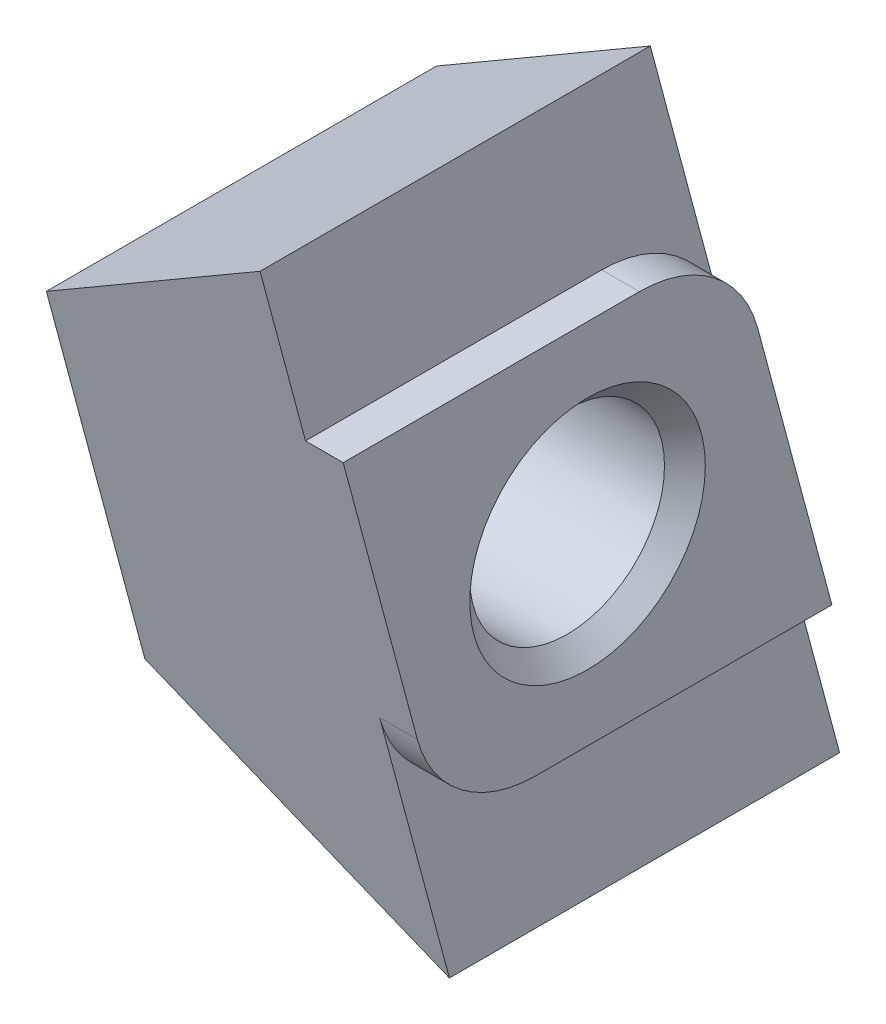
ISO-10303-21;
HEADER;
FILE_DESCRIPTION(('STEP AP214'),'2;1');
FILE_NAME('part.step','',(''),(''),'','','');
FILE_SCHEMA(('AUTOMOTIVE_DESIGN { 1 0 10303 214 1 1 1 1 }'));
ENDSEC;
DATA;
#1=APPLICATION_CONTEXT('core data for automotive mechanical design processes');
#2=APPLICATION_PROTOCOL_DEFINITION('international standard','automotive_design',2000,#1);
#3=PRODUCT_CONTEXT('',#1,'mechanical');
#4=PRODUCT('Part','Part','',(#3));
#5=PRODUCT_RELATED_PRODUCT_CATEGORY('part','',(#4));
#6=PRODUCT_DEFINITION_FORMATION('','',#4);
#7=PRODUCT_DEFINITION_CONTEXT('part definition',#1,'design');
#8=PRODUCT_DEFINITION('design','',#6,#7);
#9=PRODUCT_DEFINITION_SHAPE('','',#8);
#10=(LENGTH_UNIT() NAMED_UNIT(*) SI_UNIT(.MILLI.,.METRE.));
#11=(NAMED_UNIT(*) PLANE_ANGLE_UNIT() SI_UNIT($,.RADIAN.));
#12=(NAMED_UNIT(*) SI_UNIT($,.STERADIAN.) SOLID_ANGLE_UNIT());
#13=UNCERTAINTY_MEASURE_WITH_UNIT(LENGTH_MEASURE(1.E-05),#10,'distance_accuracy_value','');
#14=(GEOMETRIC_REPRESENTATION_CONTEXT(3) GLOBAL_UNCERTAINTY_ASSIGNED_CONTEXT((#13)) GLOBAL_UNIT_ASSIGNED_CONTEXT((#10,
#11,#12)) REPRESENTATION_CONTEXT('',''));
#15=CARTESIAN_POINT('',(0.,0.,0.));
#16=DIRECTION('',(0.,0.,1.));
#17=DIRECTION('',(1.,0.,0.));
#18=AXIS2_PLACEMENT_3D('',#15,#16,#17);
#19=CARTESIAN_POINT('',(-0.800000000000001,1.29999999999999,-1.10105270241365));
#20=DIRECTION('',(1.,0.,0.));
#21=DIRECTION('',(0.,0.,-1.));
#22=AXIS2_PLACEMENT_3D('',#19,#20,#21);
#23=CYLINDRICAL_SURFACE('',#22,2.60000000000001);
#24=CARTESIAN_POINT('',(0.,1.29999999999999,-1.10105270241365));
#25=DIRECTION('',(1.,0.,0.));
#26=DIRECTION('',(0.,0.,-1.));
#27=AXIS2_PLACEMENT_3D('',#24,#25,#26);
#28=CIRCLE('',#27,2.60000000000001);
#29=CARTESIAN_POINT('',(0.,1.97292951726655,-3.61245985076524));
#30=VERTEX_POINT('',#29);
#31=CARTESIAN_POINT('',(0.,3.9,-1.10105270241365));
#32=VERTEX_POINT('',#31);
#33=EDGE_CURVE('E154',#30,#32,#28,.T.);
#34=ORIENTED_EDGE('',*,*,#33,.F.);
#35=DIRECTION('',(1.,0.,0.));
#36=VECTOR('',#35,1.);
#37=CARTESIAN_POINT('',(-0.800000000000001,1.97292951726655,-3.61245985076524));
#38=LINE('',#37,#36);
#39=CARTESIAN_POINT('',(-0.800000000000001,1.97292951726655,-3.61245985076523));
#40=VERTEX_POINT('',#39);
#41=EDGE_CURVE('E172',#40,#30,#38,.T.);
#42=ORIENTED_EDGE('',*,*,#41,.F.);
#43=CARTESIAN_POINT('',(-0.800000000000001,1.29999999999999,-1.10105270241365));
#44=DIRECTION('',(1.,0.,0.));
#45=DIRECTION('',(0.,0.,-1.));
#46=AXIS2_PLACEMENT_3D('',#43,#44,#45);
#47=CIRCLE('',#46,2.60000000000001);
#48=CARTESIAN_POINT('',(-0.800000000000001,3.9,-1.10105270241365));
#49=VERTEX_POINT('',#48);
#50=EDGE_CURVE('E140',#40,#49,#47,.T.);
#51=ORIENTED_EDGE('',*,*,#50,.T.);
#52=DIRECTION('',(1.,0.,0.));
#53=VECTOR('',#52,1.);
#54=CARTESIAN_POINT('',(-0.800000000000001,3.9,-1.10105270241365));
#55=LINE('',#54,#53);
#56=EDGE_CURVE('E124',#49,#32,#55,.T.);
#57=ORIENTED_EDGE('',*,*,#56,.T.);
#58=EDGE_LOOP('',(#34,#42,#51,#57));
#59=FACE_BOUND('',#58,.T.);
#60=ADVANCED_FACE('F37',(#59),#23,.T.);
#61=CARTESIAN_POINT('',(-0.800000000000001,-3.9,-5.18610657212171));
#62=DIRECTION('',(0.,0.25881904510252,-0.965925826289068));
#63=DIRECTION('',(0.,0.965925826289068,0.25881904510252));
#64=AXIS2_PLACEMENT_3D('',#61,#62,#63);
#65=PLANE('',#64);
#66=DIRECTION('',(0.,0.965925826289068,0.25881904510252));
#67=VECTOR('',#66,1.);
#68=CARTESIAN_POINT('',(0.,-3.9,-5.18610657212171));
#69=LINE('',#68,#67);
#70=CARTESIAN_POINT('',(0.,-3.9,-5.18610657212171));
#71=VERTEX_POINT('',#70);
#72=EDGE_CURVE('E278',#71,#30,#69,.T.);
#73=ORIENTED_EDGE('',*,*,#72,.F.);
#74=DIRECTION('',(1.,0.,0.));
#75=VECTOR('',#74,1.);
#76=CARTESIAN_POINT('',(-0.800000000000001,-3.9,-5.18610657212171));
#77=LINE('',#76,#75);
#78=CARTESIAN_POINT('',(-0.800000000000001,-3.9,-5.18610657212171));
#79=VERTEX_POINT('',#78);
#80=EDGE_CURVE('E134',#79,#71,#77,.T.);
#81=ORIENTED_EDGE('',*,*,#80,.F.);
#82=CARTESIAN_POINT('',(-0.800000000000001,7.5,-2.13148577840691));
#83=CARTESIAN_POINT('',(-0.800000000000001,2.5,-3.47123174056252));
#84=CARTESIAN_POINT('',(-0.800000000000001,-2.5,-4.81097770271814));
#85=CARTESIAN_POINT('',(-0.800000000000001,-7.5,-6.15072366487375));
#86=B_SPLINE_CURVE_WITH_KNOTS('',3,(#82,#83,#84,#85),.UNSPECIFIED.,.F.,.F.,(4,4),(0.,1.),.UNSPECIFIED.);
#87=CARTESIAN_POINT('',(-0.800000000000001,-7.5,-6.15072366487375));
#88=VERTEX_POINT('',#87);
#89=EDGE_CURVE('E121',#79,#88,#86,.T.);
#90=ORIENTED_EDGE('',*,*,#89,.T.);
#91=DIRECTION('',(-0.827835666345006,0.541856072516727,0.145189897044757));
#92=VECTOR('',#91,1.);
#93=CARTESIAN_POINT('',(-2.53078460239917,-6.36712280570237,-5.84717013553806));
#94=LINE('',#93,#92);
#95=CARTESIAN_POINT('',(-6.3,-3.90000000000003,-5.18610657212172));
#96=VERTEX_POINT('',#95);
#97=EDGE_CURVE('E161',#96,#88,#94,.F.);
#98=ORIENTED_EDGE('',*,*,#97,.F.);
#99=CARTESIAN_POINT('',(-6.3,7.5,-2.13148577840691));
#100=CARTESIAN_POINT('',(-6.3,2.5,-3.47123174056252));
#101=CARTESIAN_POINT('',(-6.3,-2.5,-4.81097770271814));
#102=CARTESIAN_POINT('',(-6.3,-7.5,-6.15072366487375));
#103=B_SPLINE_CURVE_WITH_KNOTS('',3,(#99,#100,#101,#102),.UNSPECIFIED.,.F.,.F.,(4,4),(0.,1.),.UNSPECIFIED.);
#104=CARTESIAN_POINT('',(-6.3,3.90000000000003,-3.09610287115894));
#105=VERTEX_POINT('',#104);
#106=EDGE_CURVE('E88',#105,#96,#103,.T.);
#107=ORIENTED_EDGE('',*,*,#106,.F.);
#108=DIRECTION('',(-0.827835666345006,-0.541856072516727,-0.145189897044757));
#109=VECTOR('',#108,1.);
#110=CARTESIAN_POINT('',(-0.8,7.5,-2.13148577840691));
#111=LINE('',#110,#109);
#112=CARTESIAN_POINT('',(-0.800000000000001,7.5,-2.13148577840691));
#113=VERTEX_POINT('',#112);
#114=EDGE_CURVE('E155',#105,#113,#111,.F.);
#115=ORIENTED_EDGE('',*,*,#114,.T.);
#116=EDGE_CURVE('E228',#113,#40,#86,.T.);
#117=ORIENTED_EDGE('',*,*,#116,.T.);
#118=ORIENTED_EDGE('',*,*,#41,.T.);
#119=EDGE_LOOP('',(#73,#81,#90,#98,#107,#115,#117,#118));
#120=FACE_BOUND('',#119,.T.);
#121=ADVANCED_FACE('F198',(#120),#65,.T.);
#122=CARTESIAN_POINT('',(-0.800000000000001,-3.9,1.10105270241365));
#123=DIRECTION('',(0.,-1.,0.));
#124=DIRECTION('',(0.,0.,-1.));
#125=AXIS2_PLACEMENT_3D('',#122,#123,#124);
#126=PLANE('',#125);
#127=DIRECTION('',(0.,0.,-1.));
#128=VECTOR('',#127,1.);
#129=CARTESIAN_POINT('',(0.,-3.9,1.10105270241365));
#130=LINE('',#129,#128);
#131=CARTESIAN_POINT('',(0.,-3.9,1.10105270241365));
#132=VERTEX_POINT('',#131);
#133=EDGE_CURVE('E130',#132,#71,#130,.T.);
#134=ORIENTED_EDGE('',*,*,#133,.F.);
#135=DIRECTION('',(1.,0.,0.));
#136=VECTOR('',#135,1.);
#137=CARTESIAN_POINT('',(-0.800000000000001,-3.9,1.10105270241365));
#138=LINE('',#137,#136);
#139=CARTESIAN_POINT('',(-0.800000000000001,-3.9,1.10105270241365));
#140=VERTEX_POINT('',#139);
#141=EDGE_CURVE('E127',#140,#132,#138,.T.);
#142=ORIENTED_EDGE('',*,*,#141,.F.);
#143=DIRECTION('',(0.,0.,-1.));
#144=VECTOR('',#143,1.);
#145=CARTESIAN_POINT('',(-0.800000000000001,-3.9,1.10105270241365));
#146=LINE('',#145,#144);
#147=EDGE_CURVE('E116',#140,#79,#146,.T.);
#148=ORIENTED_EDGE('',*,*,#147,.T.);
#149=ORIENTED_EDGE('',*,*,#80,.T.);
#150=EDGE_LOOP('',(#134,#142,#148,#149));
#151=FACE_BOUND('',#150,.T.);
#152=ADVANCED_FACE('F128',(#151),#126,.T.);
#153=CARTESIAN_POINT('',(-0.800000000000001,-1.3,1.10105270241365));
#154=DIRECTION('',(1.,0.,0.));
#155=DIRECTION('',(0.,0.,-1.));
#156=AXIS2_PLACEMENT_3D('',#153,#154,#155);
#157=CYLINDRICAL_SURFACE('',#156,2.6);
#158=CARTESIAN_POINT('',(0.,-1.3,1.10105270241365));
#159=DIRECTION('',(1.,0.,0.));
#160=DIRECTION('',(0.,0.,-1.));
#161=AXIS2_PLACEMENT_3D('',#158,#159,#160);
#162=CIRCLE('',#161,2.6);
#163=CARTESIAN_POINT('',(0.,-1.97292951726655,3.61245985076523));
#164=VERTEX_POINT('',#163);
#165=EDGE_CURVE('E292',#164,#132,#162,.T.);
#166=ORIENTED_EDGE('',*,*,#165,.F.);
#167=DIRECTION('',(1.,0.,0.));
#168=VECTOR('',#167,1.);
#169=CARTESIAN_POINT('',(-0.800000000000001,-1.97292951726655,3.61245985076523));
#170=LINE('',#169,#168);
#171=CARTESIAN_POINT('',(-0.800000000000001,-1.97292951726656,3.61245985076523));
#172=VERTEX_POINT('',#171);
#173=EDGE_CURVE('E135',#172,#164,#170,.T.);
#174=ORIENTED_EDGE('',*,*,#173,.F.);
#175=CARTESIAN_POINT('',(-0.800000000000001,-1.3,1.10105270241365));
#176=DIRECTION('',(1.,0.,0.));
#177=DIRECTION('',(0.,0.,-1.));
#178=AXIS2_PLACEMENT_3D('',#175,#176,#177);
#179=CIRCLE('',#178,2.6);
#180=EDGE_CURVE('E102',#172,#140,#179,.T.);
#181=ORIENTED_EDGE('',*,*,#180,.T.);
#182=ORIENTED_EDGE('',*,*,#141,.T.);
#183=EDGE_LOOP('',(#166,#174,#181,#182));
#184=FACE_BOUND('',#183,.T.);
#185=ADVANCED_FACE('F138',(#184),#157,.T.);
#186=CARTESIAN_POINT('',(-0.800000000000001,3.9,5.18610657212171));
#187=DIRECTION('',(0.,-0.258819045102521,0.965925826289068));
#188=DIRECTION('',(0.,-0.965925826289068,-0.258819045102521));
#189=AXIS2_PLACEMENT_3D('',#186,#187,#188);
#190=PLANE('',#189);
#191=DIRECTION('',(0.,-0.965925826289068,-0.258819045102521));
#192=VECTOR('',#191,1.);
#193=CARTESIAN_POINT('',(0.,3.9,5.18610657212171));
#194=LINE('',#193,#192);
#195=CARTESIAN_POINT('',(0.,3.9,5.18610657212171));
#196=VERTEX_POINT('',#195);
#197=EDGE_CURVE('E298',#196,#164,#194,.T.);
#198=ORIENTED_EDGE('',*,*,#197,.F.);
#199=DIRECTION('',(1.,0.,0.));
#200=VECTOR('',#199,1.);
#201=CARTESIAN_POINT('',(-0.800000000000001,3.9,5.18610657212171));
#202=LINE('',#201,#200);
#203=CARTESIAN_POINT('',(-0.800000000000001,3.9,5.18610657212171));
#204=VERTEX_POINT('',#203);
#205=EDGE_CURVE('E148',#204,#196,#202,.T.);
#206=ORIENTED_EDGE('',*,*,#205,.F.);
#207=CARTESIAN_POINT('',(-0.800000000000001,-7.5,2.13148577840691));
#208=CARTESIAN_POINT('',(-0.800000000000001,-2.5,3.47123174056252));
#209=CARTESIAN_POINT('',(-0.800000000000001,2.5,4.81097770271814));
#210=CARTESIAN_POINT('',(-0.800000000000001,7.5,6.15072366487375));
#211=B_SPLINE_CURVE_WITH_KNOTS('',3,(#207,#208,#209,#210),.UNSPECIFIED.,.F.,.F.,(4,4),(0.,1.),.UNSPECIFIED.);
#212=CARTESIAN_POINT('',(-0.800000000000001,7.5,6.15072366487375));
#213=VERTEX_POINT('',#212);
#214=EDGE_CURVE('E54',#204,#213,#211,.T.);
#215=ORIENTED_EDGE('',*,*,#214,.T.);
#216=DIRECTION('',(-0.827835666345006,-0.541856072516727,-0.145189897044757));
#217=VECTOR('',#216,1.);
#218=CARTESIAN_POINT('',(-2.53078460239917,6.36712280570237,5.84717013553807));
#219=LINE('',#218,#217);
#220=CARTESIAN_POINT('',(-6.3,3.90000000000003,5.18610657212172));
#221=VERTEX_POINT('',#220);
#222=EDGE_CURVE('E151',#221,#213,#219,.F.);
#223=ORIENTED_EDGE('',*,*,#222,.F.);
#224=CARTESIAN_POINT('',(-6.3,-7.5,2.13148577840691));
#225=CARTESIAN_POINT('',(-6.3,-2.5,3.47123174056252));
#226=CARTESIAN_POINT('',(-6.3,2.5,4.81097770271814));
#227=CARTESIAN_POINT('',(-6.3,7.5,6.15072366487375));
#228=B_SPLINE_CURVE_WITH_KNOTS('',3,(#224,#225,#226,#227),.UNSPECIFIED.,.F.,.F.,(4,4),(0.,1.),.UNSPECIFIED.);
#229=CARTESIAN_POINT('',(-6.3,-3.90000000000003,3.09610287115894));
#230=VERTEX_POINT('',#229);
#231=EDGE_CURVE('E158',#230,#221,#228,.T.);
#232=ORIENTED_EDGE('',*,*,#231,.F.);
#233=DIRECTION('',(-0.827835666345006,0.541856072516727,0.145189897044757));
#234=VECTOR('',#233,1.);
#235=CARTESIAN_POINT('',(-0.800000000000001,-7.5,2.1314857784069));
#236=LINE('',#235,#234);
#237=CARTESIAN_POINT('',(-0.800000000000001,-7.5,2.13148577840691));
#238=VERTEX_POINT('',#237);
#239=EDGE_CURVE('E164',#230,#238,#236,.F.);
#240=ORIENTED_EDGE('',*,*,#239,.T.);
#241=EDGE_CURVE('E233',#238,#172,#211,.T.);
#242=ORIENTED_EDGE('',*,*,#241,.T.);
#243=ORIENTED_EDGE('',*,*,#173,.T.);
#244=EDGE_LOOP('',(#198,#206,#215,#223,#232,#240,#242,#243));
#245=FACE_BOUND('',#244,.T.);
#246=ADVANCED_FACE('F232',(#245),#190,.T.);
#247=CARTESIAN_POINT('',(-0.800000000000001,3.9,-1.10105270241365));
#248=DIRECTION('',(0.,1.,0.));
#249=DIRECTION('',(0.,0.,1.));
#250=AXIS2_PLACEMENT_3D('',#247,#248,#249);
#251=PLANE('',#250);
#252=DIRECTION('',(0.,0.,1.));
#253=VECTOR('',#252,1.);
#254=CARTESIAN_POINT('',(0.,3.9,-1.10105270241365));
#255=LINE('',#254,#253);
#256=EDGE_CURVE('E296',#32,#196,#255,.T.);
#257=ORIENTED_EDGE('',*,*,#256,.F.);
#258=ORIENTED_EDGE('',*,*,#56,.F.);
#259=DIRECTION('',(0.,0.,1.));
#260=VECTOR('',#259,1.);
#261=CARTESIAN_POINT('',(-0.800000000000001,3.9,-1.10105270241365));
#262=LINE('',#261,#260);
#263=EDGE_CURVE('E113',#49,#204,#262,.T.);
#264=ORIENTED_EDGE('',*,*,#263,.T.);
#265=ORIENTED_EDGE('',*,*,#205,.T.);
#266=EDGE_LOOP('',(#257,#258,#264,#265));
#267=FACE_BOUND('',#266,.T.);
#268=ADVANCED_FACE('F209',(#267),#251,.T.);
#269=CARTESIAN_POINT('',(0.,1.29999999999999,-1.10105270241365));
#270=DIRECTION('',(1.,0.,0.));
#271=DIRECTION('',(0.,0.,-1.));
#272=AXIS2_PLACEMENT_3D('',#269,#270,#271);
#273=PLANE('',#272);
#274=CARTESIAN_POINT('',(0.,0.,0.));
#275=DIRECTION('',(1.,0.,0.));
#276=DIRECTION('',(0.,0.,-1.));
#277=AXIS2_PLACEMENT_3D('',#274,#275,#276);
#278=CIRCLE('',#277,2.49999999999966);
#279=CARTESIAN_POINT('',(0.,0.,-2.49999999999966));
#280=VERTEX_POINT('',#279);
#281=EDGE_CURVE('E46',#280,#280,#278,.F.);
#282=ORIENTED_EDGE('',*,*,#281,.T.);
#283=EDGE_LOOP('',(#282));
#284=FACE_BOUND('',#283,.T.);
#285=ORIENTED_EDGE('',*,*,#33,.T.);
#286=ORIENTED_EDGE('',*,*,#256,.T.);
#287=ORIENTED_EDGE('',*,*,#197,.T.);
#288=ORIENTED_EDGE('',*,*,#165,.T.);
#289=ORIENTED_EDGE('',*,*,#133,.T.);
#290=ORIENTED_EDGE('',*,*,#72,.T.);
#291=EDGE_LOOP('',(#285,#286,#287,#288,#289,#290));
#292=FACE_BOUND('',#291,.T.);
#293=ADVANCED_FACE('F177',(#284,#292),#273,.T.);
#294=CARTESIAN_POINT('',(-0.800000000000001,0.,4.14110472164033));
#295=DIRECTION('',(-1.,0.,0.));
#296=DIRECTION('',(0.,0.,1.));
#297=AXIS2_PLACEMENT_3D('',#294,#295,#296);
#298=PLANE('',#297);
#299=ORIENTED_EDGE('',*,*,#147,.F.);
#300=ORIENTED_EDGE('',*,*,#180,.F.);
#301=ORIENTED_EDGE('',*,*,#241,.F.);
#302=DIRECTION('',(0.,0.,1.));
#303=VECTOR('',#302,1.);
#304=CARTESIAN_POINT('',(-0.800000000000001,-7.5,2.13148577840691));
#305=LINE('',#304,#303);
#306=EDGE_CURVE('E225',#88,#238,#305,.T.);
#307=ORIENTED_EDGE('',*,*,#306,.F.);
#308=ORIENTED_EDGE('',*,*,#89,.F.);
#309=EDGE_LOOP('',(#299,#300,#301,#307,#308));
#310=FACE_BOUND('',#309,.T.);
#311=ADVANCED_FACE('F118',(#310),#298,.F.);
#312=CARTESIAN_POINT('',(-0.800000000000001,7.5,-2.13148577840691));
#313=DIRECTION('',(-0.547659174694385,0.836701516894206,0.));
#314=DIRECTION('',(-0.836701516894206,-0.547659174694385,0.));
#315=AXIS2_PLACEMENT_3D('',#312,#313,#314);
#316=PLANE('',#315);
#317=DIRECTION('',(0.,0.,-1.));
#318=VECTOR('',#317,1.);
#319=CARTESIAN_POINT('',(-0.800000000000001,7.5,-2.13148577840691));
#320=LINE('',#319,#318);
#321=EDGE_CURVE('E235',#213,#113,#320,.T.);
#322=ORIENTED_EDGE('',*,*,#321,.T.);
#323=ORIENTED_EDGE('',*,*,#114,.F.);
#324=DIRECTION('',(0.,0.,1.));
#325=VECTOR('',#324,1.);
#326=CARTESIAN_POINT('',(-6.3,3.90000000000003,-2.13148577840691));
#327=LINE('',#326,#325);
#328=EDGE_CURVE('E156',#221,#105,#327,.F.);
#329=ORIENTED_EDGE('',*,*,#328,.F.);
#330=ORIENTED_EDGE('',*,*,#222,.T.);
#331=EDGE_LOOP('',(#322,#323,#329,#330));
#332=FACE_BOUND('',#331,.T.);
#333=ADVANCED_FACE('F211',(#332),#316,.T.);
#334=CARTESIAN_POINT('',(-0.800000000000001,-7.5,2.13148577840691));
#335=DIRECTION('',(-0.547659174694385,-0.836701516894206,0.));
#336=DIRECTION('',(0.836701516894206,-0.547659174694385,0.));
#337=AXIS2_PLACEMENT_3D('',#334,#335,#336);
#338=PLANE('',#337);
#339=ORIENTED_EDGE('',*,*,#306,.T.);
#340=ORIENTED_EDGE('',*,*,#239,.F.);
#341=DIRECTION('',(0.,0.,-1.));
#342=VECTOR('',#341,1.);
#343=CARTESIAN_POINT('',(-6.3,-3.90000000000003,2.13148577840691));
#344=LINE('',#343,#342);
#345=EDGE_CURVE('E93',#96,#230,#344,.F.);
#346=ORIENTED_EDGE('',*,*,#345,.F.);
#347=ORIENTED_EDGE('',*,*,#97,.T.);
#348=EDGE_LOOP('',(#339,#340,#346,#347));
#349=FACE_BOUND('',#348,.T.);
#350=ADVANCED_FACE('F214',(#349),#338,.T.);
#351=CARTESIAN_POINT('',(-6.3,0.,4.14110472164033));
#352=DIRECTION('',(-1.,0.,0.));
#353=DIRECTION('',(0.,0.,1.));
#354=AXIS2_PLACEMENT_3D('',#351,#352,#353);
#355=PLANE('',#354);
#356=CARTESIAN_POINT('',(-6.3,0.,0.));
#357=DIRECTION('',(-1.,0.,0.));
#358=DIRECTION('',(0.,0.,1.));
#359=AXIS2_PLACEMENT_3D('',#356,#357,#358);
#360=CIRCLE('',#359,2.49999999999965);
#361=CARTESIAN_POINT('',(-6.3,0.,2.49999999999965));
#362=VERTEX_POINT('',#361);
#363=EDGE_CURVE('E11',#362,#362,#360,.F.);
#364=ORIENTED_EDGE('',*,*,#363,.T.);
#365=EDGE_LOOP('',(#364));
#366=FACE_BOUND('',#365,.T.);
#367=ORIENTED_EDGE('',*,*,#231,.T.);
#368=ORIENTED_EDGE('',*,*,#328,.T.);
#369=ORIENTED_EDGE('',*,*,#106,.T.);
#370=ORIENTED_EDGE('',*,*,#345,.T.);
#371=EDGE_LOOP('',(#367,#368,#369,#370));
#372=FACE_BOUND('',#371,.T.);
#373=ADVANCED_FACE('F217',(#366,#372),#355,.T.);
#374=ORIENTED_EDGE('',*,*,#50,.F.);
#375=ORIENTED_EDGE('',*,*,#116,.F.);
#376=ORIENTED_EDGE('',*,*,#321,.F.);
#377=ORIENTED_EDGE('',*,*,#214,.F.);
#378=ORIENTED_EDGE('',*,*,#263,.F.);
#379=EDGE_LOOP('',(#374,#375,#376,#377,#378));
#380=FACE_BOUND('',#379,.T.);
#381=ADVANCED_FACE('F188',(#380),#298,.F.);
#382=CARTESIAN_POINT('',(-6.3,0.,0.));
#383=DIRECTION('',(-1.,0.,0.));
#384=DIRECTION('',(0.,0.,1.));
#385=AXIS2_PLACEMENT_3D('',#382,#383,#384);
#386=CYLINDRICAL_SURFACE('',#385,2.06699999999999);
#387=CARTESIAN_POINT('',(-0.432999999999665,0.,0.));
#388=DIRECTION('',(1.,0.,0.));
#389=DIRECTION('',(0.,0.,-1.));
#390=AXIS2_PLACEMENT_3D('',#387,#388,#389);
#391=CIRCLE('',#390,2.06699999999999);
#392=CARTESIAN_POINT('',(-0.432999999999665,0.,-2.06699999999999));
#393=VERTEX_POINT('',#392);
#394=EDGE_CURVE('E171',#393,#393,#391,.T.);
#395=ORIENTED_EDGE('',*,*,#394,.T.);
#396=EDGE_LOOP('',(#395));
#397=FACE_BOUND('',#396,.T.);
#398=CARTESIAN_POINT('',(-5.86700000000034,0.,0.));
#399=DIRECTION('',(-1.,0.,0.));
#400=DIRECTION('',(0.,0.,1.));
#401=AXIS2_PLACEMENT_3D('',#398,#399,#400);
#402=CIRCLE('',#401,2.06699999999999);
#403=CARTESIAN_POINT('',(-5.86700000000034,0.,2.06699999999999));
#404=VERTEX_POINT('',#403);
#405=EDGE_CURVE('E168',#404,#404,#402,.T.);
#406=ORIENTED_EDGE('',*,*,#405,.T.);
#407=EDGE_LOOP('',(#406));
#408=FACE_BOUND('',#407,.T.);
#409=ADVANCED_FACE('F183',(#397,#408),#386,.F.);
#410=CARTESIAN_POINT('',(-0.432999999999665,0.,0.));
#411=DIRECTION('',(1.,0.,0.));
#412=DIRECTION('',(0.,0.,-1.));
#413=AXIS2_PLACEMENT_3D('',#410,#411,#412);
#414=CONICAL_SURFACE('',#413,2.06699999999999,0.785398163397451);
#415=ORIENTED_EDGE('',*,*,#281,.F.);
#416=EDGE_LOOP('',(#415));
#417=FACE_BOUND('',#416,.T.);
#418=ORIENTED_EDGE('',*,*,#394,.F.);
#419=EDGE_LOOP('',(#418));
#420=FACE_BOUND('',#419,.T.);
#421=ADVANCED_FACE('F180',(#417,#420),#414,.F.);
#422=CARTESIAN_POINT('',(-5.86700000000034,0.,0.));
#423=DIRECTION('',(-1.,0.,0.));
#424=DIRECTION('',(0.,0.,1.));
#425=AXIS2_PLACEMENT_3D('',#422,#423,#424);
#426=CONICAL_SURFACE('',#425,2.06699999999999,0.785398163397456);
#427=ORIENTED_EDGE('',*,*,#363,.F.);
#428=EDGE_LOOP('',(#427));
#429=FACE_BOUND('',#428,.T.);
#430=ORIENTED_EDGE('',*,*,#405,.F.);
#431=EDGE_LOOP('',(#430));
#432=FACE_BOUND('',#431,.T.);
#433=ADVANCED_FACE('F39',(#429,#432),#426,.F.);
#434=CLOSED_SHELL('',(#60,#121,#152,#185,#246,#268,#293,#311,#333,#350,#373,#381,#409,#421,#433));
#435=MANIFOLD_SOLID_BREP('B2',#434);
#436=ADVANCED_BREP_SHAPE_REPRESENTATION('',(#18,#435),#14);
#437=SHAPE_DEFINITION_REPRESENTATION(#9,#436);
ENDSEC;
END-ISO-10303-21;
